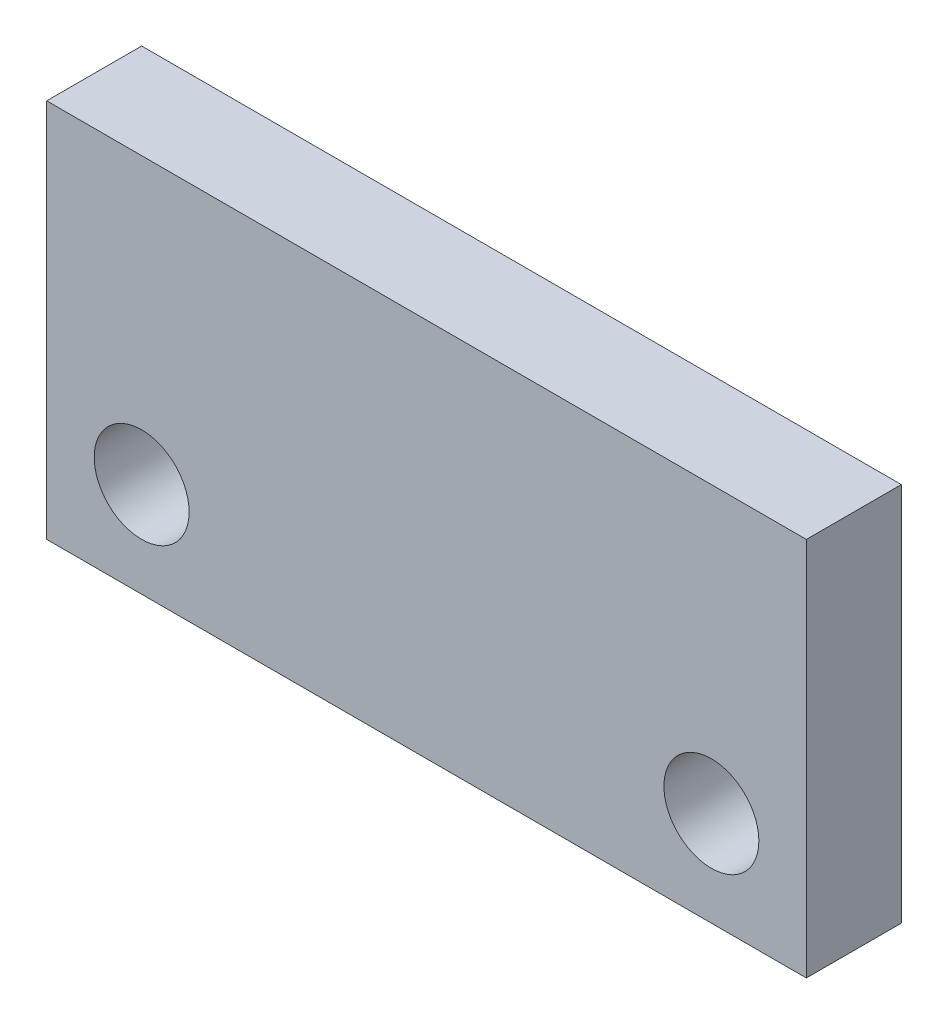
ISO-10303-21;
HEADER;
FILE_DESCRIPTION(('STEP AP214'),'2;1');
FILE_NAME('part.step','',(''),(''),'','','');
FILE_SCHEMA(('AUTOMOTIVE_DESIGN { 1 0 10303 214 1 1 1 1 }'));
ENDSEC;
DATA;
#1=APPLICATION_CONTEXT('core data for automotive mechanical design processes');
#2=APPLICATION_PROTOCOL_DEFINITION('international standard','automotive_design',2000,#1);
#3=PRODUCT_CONTEXT('',#1,'mechanical');
#4=PRODUCT('Part','Part','',(#3));
#5=PRODUCT_RELATED_PRODUCT_CATEGORY('part','',(#4));
#6=PRODUCT_DEFINITION_FORMATION('','',#4);
#7=PRODUCT_DEFINITION_CONTEXT('part definition',#1,'design');
#8=PRODUCT_DEFINITION('design','',#6,#7);
#9=PRODUCT_DEFINITION_SHAPE('','',#8);
#10=(LENGTH_UNIT() NAMED_UNIT(*) SI_UNIT(.MILLI.,.METRE.));
#11=(NAMED_UNIT(*) PLANE_ANGLE_UNIT() SI_UNIT($,.RADIAN.));
#12=(NAMED_UNIT(*) SI_UNIT($,.STERADIAN.) SOLID_ANGLE_UNIT());
#13=UNCERTAINTY_MEASURE_WITH_UNIT(LENGTH_MEASURE(1.E-05),#10,'distance_accuracy_value','');
#14=(GEOMETRIC_REPRESENTATION_CONTEXT(3) GLOBAL_UNCERTAINTY_ASSIGNED_CONTEXT((#13)) GLOBAL_UNIT_ASSIGNED_CONTEXT((#10,
#11,#12)) REPRESENTATION_CONTEXT('',''));
#15=CARTESIAN_POINT('',(0.,0.,0.));
#16=DIRECTION('',(0.,0.,1.));
#17=DIRECTION('',(1.,0.,0.));
#18=AXIS2_PLACEMENT_3D('',#15,#16,#17);
#19=CARTESIAN_POINT('',(0.,0.,6.35));
#20=DIRECTION('',(0.,0.,-1.));
#21=DIRECTION('',(-1.,0.,0.));
#22=AXIS2_PLACEMENT_3D('',#19,#20,#21);
#23=PLANE('',#22);
#24=DIRECTION('',(0.,-1.,0.));
#25=VECTOR('',#24,1.);
#26=CARTESIAN_POINT('',(0.,0.,6.35));
#27=LINE('',#26,#25);
#28=CARTESIAN_POINT('',(0.,25.4,6.35));
#29=VERTEX_POINT('',#28);
#30=CARTESIAN_POINT('',(0.,0.,6.35));
#31=VERTEX_POINT('',#30);
#32=EDGE_CURVE('E85',#29,#31,#27,.T.);
#33=ORIENTED_EDGE('',*,*,#32,.T.);
#34=DIRECTION('',(1.,0.,0.));
#35=VECTOR('',#34,1.);
#36=CARTESIAN_POINT('',(0.,0.,6.35));
#37=LINE('',#36,#35);
#38=CARTESIAN_POINT('',(50.8,0.,6.35));
#39=VERTEX_POINT('',#38);
#40=EDGE_CURVE('E80',#31,#39,#37,.T.);
#41=ORIENTED_EDGE('',*,*,#40,.T.);
#42=DIRECTION('',(0.,1.,0.));
#43=VECTOR('',#42,1.);
#44=CARTESIAN_POINT('',(50.8,0.,6.35));
#45=LINE('',#44,#43);
#46=CARTESIAN_POINT('',(50.8,25.4,6.35));
#47=VERTEX_POINT('',#46);
#48=EDGE_CURVE('E83',#39,#47,#45,.T.);
#49=ORIENTED_EDGE('',*,*,#48,.T.);
#50=DIRECTION('',(-1.,0.,0.));
#51=VECTOR('',#50,1.);
#52=CARTESIAN_POINT('',(0.,25.4,6.35));
#53=LINE('',#52,#51);
#54=EDGE_CURVE('E50',#47,#29,#53,.T.);
#55=ORIENTED_EDGE('',*,*,#54,.T.);
#56=EDGE_LOOP('',(#33,#41,#49,#55));
#57=FACE_BOUND('',#56,.T.);
#58=CARTESIAN_POINT('',(6.35,6.35,6.35));
#59=DIRECTION('',(0.,0.,1.));
#60=DIRECTION('',(1.,0.,0.));
#61=AXIS2_PLACEMENT_3D('',#58,#59,#60);
#62=CIRCLE('',#61,3.175);
#63=CARTESIAN_POINT('',(9.525,6.35,6.35));
#64=VERTEX_POINT('',#63);
#65=EDGE_CURVE('E100',#64,#64,#62,.T.);
#66=ORIENTED_EDGE('',*,*,#65,.F.);
#67=EDGE_LOOP('',(#66));
#68=FACE_BOUND('',#67,.T.);
#69=CARTESIAN_POINT('',(44.45,6.35,6.35));
#70=DIRECTION('',(0.,0.,1.));
#71=DIRECTION('',(1.,0.,0.));
#72=AXIS2_PLACEMENT_3D('',#69,#70,#71);
#73=CIRCLE('',#72,3.175);
#74=CARTESIAN_POINT('',(47.625,6.35,6.35));
#75=VERTEX_POINT('',#74);
#76=EDGE_CURVE('E115',#75,#75,#73,.T.);
#77=ORIENTED_EDGE('',*,*,#76,.F.);
#78=EDGE_LOOP('',(#77));
#79=FACE_BOUND('',#78,.T.);
#80=ADVANCED_FACE('F33',(#57,#68,#79),#23,.F.);
#81=CARTESIAN_POINT('',(0.,0.,0.));
#82=DIRECTION('',(0.,0.,-1.));
#83=DIRECTION('',(-1.,0.,0.));
#84=AXIS2_PLACEMENT_3D('',#81,#82,#83);
#85=PLANE('',#84);
#86=CARTESIAN_POINT('',(6.35,6.35,0.));
#87=DIRECTION('',(0.,0.,1.));
#88=DIRECTION('',(1.,0.,0.));
#89=AXIS2_PLACEMENT_3D('',#86,#87,#88);
#90=CIRCLE('',#89,3.175);
#91=CARTESIAN_POINT('',(9.525,6.35,0.));
#92=VERTEX_POINT('',#91);
#93=EDGE_CURVE('E112',#92,#92,#90,.T.);
#94=ORIENTED_EDGE('',*,*,#93,.T.);
#95=EDGE_LOOP('',(#94));
#96=FACE_BOUND('',#95,.T.);
#97=DIRECTION('',(0.,-1.,0.));
#98=VECTOR('',#97,1.);
#99=CARTESIAN_POINT('',(0.,0.,0.));
#100=LINE('',#99,#98);
#101=CARTESIAN_POINT('',(0.,25.4,0.));
#102=VERTEX_POINT('',#101);
#103=CARTESIAN_POINT('',(0.,0.,0.));
#104=VERTEX_POINT('',#103);
#105=EDGE_CURVE('E97',#102,#104,#100,.T.);
#106=ORIENTED_EDGE('',*,*,#105,.F.);
#107=DIRECTION('',(-1.,0.,0.));
#108=VECTOR('',#107,1.);
#109=CARTESIAN_POINT('',(0.,25.4,0.));
#110=LINE('',#109,#108);
#111=CARTESIAN_POINT('',(50.8,25.4,0.));
#112=VERTEX_POINT('',#111);
#113=EDGE_CURVE('E73',#112,#102,#110,.T.);
#114=ORIENTED_EDGE('',*,*,#113,.F.);
#115=DIRECTION('',(0.,1.,0.));
#116=VECTOR('',#115,1.);
#117=CARTESIAN_POINT('',(50.8,0.,0.));
#118=LINE('',#117,#116);
#119=CARTESIAN_POINT('',(50.8,0.,0.));
#120=VERTEX_POINT('',#119);
#121=EDGE_CURVE('E67',#120,#112,#118,.T.);
#122=ORIENTED_EDGE('',*,*,#121,.F.);
#123=DIRECTION('',(1.,0.,0.));
#124=VECTOR('',#123,1.);
#125=CARTESIAN_POINT('',(0.,0.,0.));
#126=LINE('',#125,#124);
#127=EDGE_CURVE('E89',#104,#120,#126,.T.);
#128=ORIENTED_EDGE('',*,*,#127,.F.);
#129=EDGE_LOOP('',(#106,#114,#122,#128));
#130=FACE_BOUND('',#129,.T.);
#131=CARTESIAN_POINT('',(44.45,6.35,0.));
#132=DIRECTION('',(0.,0.,1.));
#133=DIRECTION('',(1.,0.,0.));
#134=AXIS2_PLACEMENT_3D('',#131,#132,#133);
#135=CIRCLE('',#134,3.175);
#136=CARTESIAN_POINT('',(47.625,6.35,0.));
#137=VERTEX_POINT('',#136);
#138=EDGE_CURVE('E118',#137,#137,#135,.T.);
#139=ORIENTED_EDGE('',*,*,#138,.T.);
#140=EDGE_LOOP('',(#139));
#141=FACE_BOUND('',#140,.T.);
#142=ADVANCED_FACE('F108',(#96,#130,#141),#85,.T.);
#143=CARTESIAN_POINT('',(0.,0.,6.35));
#144=DIRECTION('',(1.,0.,0.));
#145=DIRECTION('',(0.,0.,-1.));
#146=AXIS2_PLACEMENT_3D('',#143,#144,#145);
#147=PLANE('',#146);
#148=ORIENTED_EDGE('',*,*,#105,.T.);
#149=DIRECTION('',(0.,0.,-1.));
#150=VECTOR('',#149,1.);
#151=CARTESIAN_POINT('',(0.,0.,6.35));
#152=LINE('',#151,#150);
#153=EDGE_CURVE('E11',#31,#104,#152,.T.);
#154=ORIENTED_EDGE('',*,*,#153,.F.);
#155=ORIENTED_EDGE('',*,*,#32,.F.);
#156=DIRECTION('',(0.,0.,-1.));
#157=VECTOR('',#156,1.);
#158=CARTESIAN_POINT('',(0.,25.4,6.35));
#159=LINE('',#158,#157);
#160=EDGE_CURVE('E93',#29,#102,#159,.T.);
#161=ORIENTED_EDGE('',*,*,#160,.T.);
#162=EDGE_LOOP('',(#148,#154,#155,#161));
#163=FACE_BOUND('',#162,.T.);
#164=ADVANCED_FACE('F35',(#163),#147,.F.);
#165=CARTESIAN_POINT('',(0.,0.,6.35));
#166=DIRECTION('',(0.,1.,0.));
#167=DIRECTION('',(0.,0.,1.));
#168=AXIS2_PLACEMENT_3D('',#165,#166,#167);
#169=PLANE('',#168);
#170=ORIENTED_EDGE('',*,*,#127,.T.);
#171=DIRECTION('',(0.,0.,-1.));
#172=VECTOR('',#171,1.);
#173=CARTESIAN_POINT('',(50.8,0.,6.35));
#174=LINE('',#173,#172);
#175=EDGE_CURVE('E42',#39,#120,#174,.T.);
#176=ORIENTED_EDGE('',*,*,#175,.F.);
#177=ORIENTED_EDGE('',*,*,#40,.F.);
#178=ORIENTED_EDGE('',*,*,#153,.T.);
#179=EDGE_LOOP('',(#170,#176,#177,#178));
#180=FACE_BOUND('',#179,.T.);
#181=ADVANCED_FACE('F88',(#180),#169,.F.);
#182=CARTESIAN_POINT('',(50.8,0.,6.35));
#183=DIRECTION('',(-1.,0.,0.));
#184=DIRECTION('',(0.,0.,1.));
#185=AXIS2_PLACEMENT_3D('',#182,#183,#184);
#186=PLANE('',#185);
#187=ORIENTED_EDGE('',*,*,#121,.T.);
#188=DIRECTION('',(0.,0.,-1.));
#189=VECTOR('',#188,1.);
#190=CARTESIAN_POINT('',(50.8,25.4,6.35));
#191=LINE('',#190,#189);
#192=EDGE_CURVE('E90',#47,#112,#191,.T.);
#193=ORIENTED_EDGE('',*,*,#192,.F.);
#194=ORIENTED_EDGE('',*,*,#48,.F.);
#195=ORIENTED_EDGE('',*,*,#175,.T.);
#196=EDGE_LOOP('',(#187,#193,#194,#195));
#197=FACE_BOUND('',#196,.T.);
#198=ADVANCED_FACE('F91',(#197),#186,.F.);
#199=CARTESIAN_POINT('',(0.,25.4,6.35));
#200=DIRECTION('',(0.,-1.,0.));
#201=DIRECTION('',(0.,0.,-1.));
#202=AXIS2_PLACEMENT_3D('',#199,#200,#201);
#203=PLANE('',#202);
#204=ORIENTED_EDGE('',*,*,#113,.T.);
#205=ORIENTED_EDGE('',*,*,#160,.F.);
#206=ORIENTED_EDGE('',*,*,#54,.F.);
#207=ORIENTED_EDGE('',*,*,#192,.T.);
#208=EDGE_LOOP('',(#204,#205,#206,#207));
#209=FACE_BOUND('',#208,.T.);
#210=ADVANCED_FACE('F105',(#209),#203,.F.);
#211=CARTESIAN_POINT('',(6.35,6.35,6.35));
#212=DIRECTION('',(0.,0.,-1.));
#213=DIRECTION('',(-1.,0.,0.));
#214=AXIS2_PLACEMENT_3D('',#211,#212,#213);
#215=CYLINDRICAL_SURFACE('',#214,3.175);
#216=ORIENTED_EDGE('',*,*,#65,.T.);
#217=EDGE_LOOP('',(#216));
#218=FACE_BOUND('',#217,.T.);
#219=ORIENTED_EDGE('',*,*,#93,.F.);
#220=EDGE_LOOP('',(#219));
#221=FACE_BOUND('',#220,.T.);
#222=ADVANCED_FACE('F135',(#218,#221),#215,.F.);
#223=CARTESIAN_POINT('',(44.45,6.35,6.35));
#224=DIRECTION('',(0.,0.,-1.));
#225=DIRECTION('',(-1.,0.,0.));
#226=AXIS2_PLACEMENT_3D('',#223,#224,#225);
#227=CYLINDRICAL_SURFACE('',#226,3.175);
#228=ORIENTED_EDGE('',*,*,#76,.T.);
#229=EDGE_LOOP('',(#228));
#230=FACE_BOUND('',#229,.T.);
#231=ORIENTED_EDGE('',*,*,#138,.F.);
#232=EDGE_LOOP('',(#231));
#233=FACE_BOUND('',#232,.T.);
#234=ADVANCED_FACE('F124',(#230,#233),#227,.F.);
#235=CLOSED_SHELL('',(#80,#142,#164,#181,#198,#210,#222,#234));
#236=MANIFOLD_SOLID_BREP('B2',#235);
#237=ADVANCED_BREP_SHAPE_REPRESENTATION('',(#18,#236),#14);
#238=SHAPE_DEFINITION_REPRESENTATION(#9,#237);
ENDSEC;
END-ISO-10303-21;
